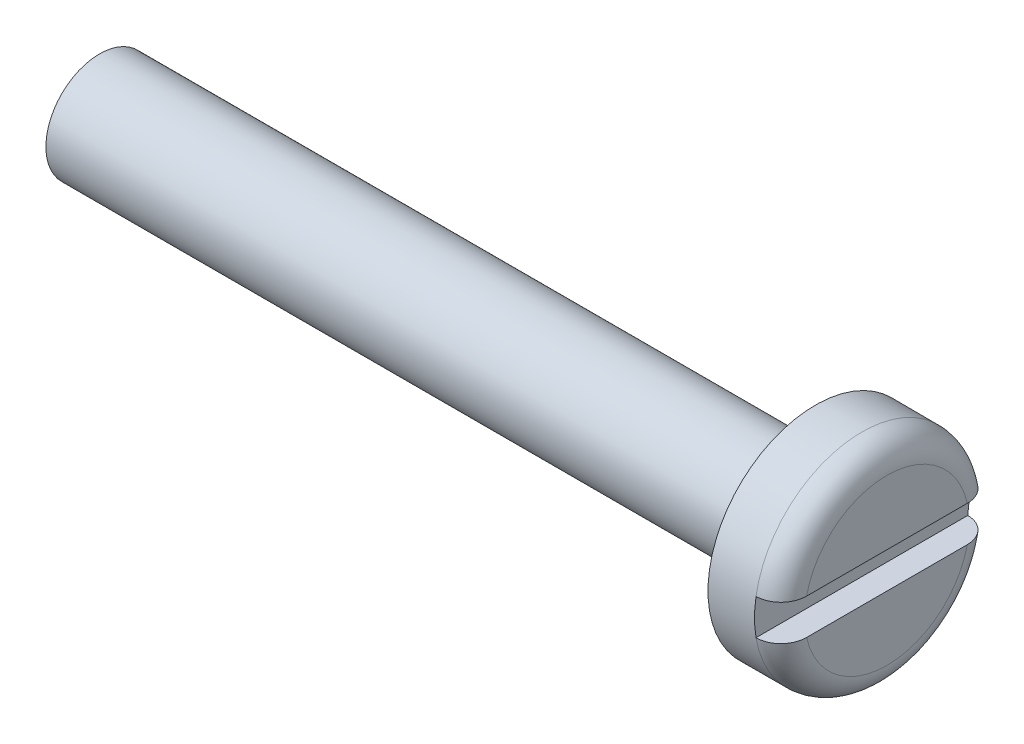
ISO-10303-21;
HEADER;
FILE_DESCRIPTION(('STEP AP214'),'2;1');
FILE_NAME('part.step','',(''),(''),'','','');
FILE_SCHEMA(('AUTOMOTIVE_DESIGN { 1 0 10303 214 1 1 1 1 }'));
ENDSEC;
DATA;
#1=APPLICATION_CONTEXT('core data for automotive mechanical design processes');
#2=APPLICATION_PROTOCOL_DEFINITION('international standard','automotive_design',2000,#1);
#3=PRODUCT_CONTEXT('',#1,'mechanical');
#4=PRODUCT('Part','Part','',(#3));
#5=PRODUCT_RELATED_PRODUCT_CATEGORY('part','',(#4));
#6=PRODUCT_DEFINITION_FORMATION('','',#4);
#7=PRODUCT_DEFINITION_CONTEXT('part definition',#1,'design');
#8=PRODUCT_DEFINITION('design','',#6,#7);
#9=PRODUCT_DEFINITION_SHAPE('','',#8);
#10=(LENGTH_UNIT() NAMED_UNIT(*) SI_UNIT(.MILLI.,.METRE.));
#11=(NAMED_UNIT(*) PLANE_ANGLE_UNIT() SI_UNIT($,.RADIAN.));
#12=(NAMED_UNIT(*) SI_UNIT($,.STERADIAN.) SOLID_ANGLE_UNIT());
#13=UNCERTAINTY_MEASURE_WITH_UNIT(LENGTH_MEASURE(1.E-05),#10,'distance_accuracy_value','');
#14=(GEOMETRIC_REPRESENTATION_CONTEXT(3) GLOBAL_UNCERTAINTY_ASSIGNED_CONTEXT((#13)) GLOBAL_UNIT_ASSIGNED_CONTEXT((#10,
#11,#12)) REPRESENTATION_CONTEXT('',''));
#15=CARTESIAN_POINT('',(0.,0.,0.));
#16=DIRECTION('',(0.,0.,1.));
#17=DIRECTION('',(1.,0.,0.));
#18=AXIS2_PLACEMENT_3D('',#15,#16,#17);
#19=CARTESIAN_POINT('',(2.,0.,0.));
#20=DIRECTION('',(1.,0.,0.));
#21=DIRECTION('',(0.,0.,-1.));
#22=AXIS2_PLACEMENT_3D('',#19,#20,#21);
#23=PLANE('',#22);
#24=DIRECTION('',(0.,0.,1.));
#25=VECTOR('',#24,1.);
#26=CARTESIAN_POINT('',(2.,0.5,0.));
#27=LINE('',#26,#25);
#28=CARTESIAN_POINT('',(2.,0.5,-2.24499443206437));
#29=VERTEX_POINT('',#28);
#30=CARTESIAN_POINT('',(2.,0.5,2.24499443206437));
#31=VERTEX_POINT('',#30);
#32=EDGE_CURVE('E166',#29,#31,#27,.T.);
#33=ORIENTED_EDGE('',*,*,#32,.F.);
#34=CARTESIAN_POINT('',(2.,0.,0.));
#35=DIRECTION('',(1.,0.,0.));
#36=DIRECTION('',(0.,0.,-1.));
#37=AXIS2_PLACEMENT_3D('',#34,#35,#36);
#38=CIRCLE('',#37,2.3);
#39=EDGE_CURVE('E93',#29,#31,#38,.T.);
#40=ORIENTED_EDGE('',*,*,#39,.T.);
#41=EDGE_LOOP('',(#33,#40));
#42=FACE_BOUND('',#41,.T.);
#43=ADVANCED_FACE('F36',(#42),#23,.T.);
#44=CARTESIAN_POINT('',(0.,0.,0.));
#45=DIRECTION('',(1.,0.,0.));
#46=DIRECTION('',(0.,0.,-1.));
#47=AXIS2_PLACEMENT_3D('',#44,#45,#46);
#48=CYLINDRICAL_SURFACE('',#47,1.5);
#49=CARTESIAN_POINT('',(-20.,0.,0.));
#50=DIRECTION('',(1.,0.,0.));
#51=DIRECTION('',(0.,0.,-1.));
#52=AXIS2_PLACEMENT_3D('',#49,#50,#51);
#53=CIRCLE('',#52,1.5);
#54=CARTESIAN_POINT('',(-20.,0.,-1.5));
#55=VERTEX_POINT('',#54);
#56=EDGE_CURVE('E160',#55,#55,#53,.T.);
#57=ORIENTED_EDGE('',*,*,#56,.T.);
#58=EDGE_LOOP('',(#57));
#59=FACE_BOUND('',#58,.T.);
#60=CARTESIAN_POINT('',(0.,0.,0.));
#61=DIRECTION('',(1.,0.,0.));
#62=DIRECTION('',(0.,0.,-1.));
#63=AXIS2_PLACEMENT_3D('',#60,#61,#62);
#64=CIRCLE('',#63,1.5);
#65=CARTESIAN_POINT('',(0.,0.,-1.5));
#66=VERTEX_POINT('',#65);
#67=EDGE_CURVE('E163',#66,#66,#64,.T.);
#68=ORIENTED_EDGE('',*,*,#67,.F.);
#69=EDGE_LOOP('',(#68));
#70=FACE_BOUND('',#69,.T.);
#71=ADVANCED_FACE('F149',(#59,#70),#48,.T.);
#72=CARTESIAN_POINT('',(-20.,0.,0.));
#73=DIRECTION('',(1.,0.,0.));
#74=DIRECTION('',(0.,0.,-1.));
#75=AXIS2_PLACEMENT_3D('',#72,#73,#74);
#76=PLANE('',#75);
#77=ORIENTED_EDGE('',*,*,#56,.F.);
#78=EDGE_LOOP('',(#77));
#79=FACE_BOUND('',#78,.T.);
#80=ADVANCED_FACE('F147',(#79),#76,.F.);
#81=CARTESIAN_POINT('',(2.,0.,0.));
#82=DIRECTION('',(-1.,0.,0.));
#83=DIRECTION('',(0.,0.,1.));
#84=AXIS2_PLACEMENT_3D('',#81,#82,#83);
#85=CYLINDRICAL_SURFACE('',#84,3.);
#86=CARTESIAN_POINT('',(1.3,0.,0.));
#87=DIRECTION('',(1.,0.,0.));
#88=DIRECTION('',(0.,0.,-1.));
#89=AXIS2_PLACEMENT_3D('',#86,#87,#88);
#90=CIRCLE('',#89,3.);
#91=CARTESIAN_POINT('',(1.3,-0.5,-2.95803989154981));
#92=VERTEX_POINT('',#91);
#93=CARTESIAN_POINT('',(1.3,0.5,-2.95803989154981));
#94=VERTEX_POINT('',#93);
#95=EDGE_CURVE('E90',#92,#94,#90,.T.);
#96=ORIENTED_EDGE('',*,*,#95,.F.);
#97=CARTESIAN_POINT('',(1.3,0.,0.));
#98=DIRECTION('',(1.,0.,0.));
#99=DIRECTION('',(0.,0.,-1.));
#100=AXIS2_PLACEMENT_3D('',#97,#98,#99);
#101=CIRCLE('',#100,3.);
#102=CARTESIAN_POINT('',(1.3,-0.5,2.95803989154981));
#103=VERTEX_POINT('',#102);
#104=EDGE_CURVE('E84',#92,#103,#101,.F.);
#105=ORIENTED_EDGE('',*,*,#104,.T.);
#106=CARTESIAN_POINT('',(1.3,0.5,2.95803989154981));
#107=VERTEX_POINT('',#106);
#108=EDGE_CURVE('E88',#107,#103,#90,.T.);
#109=ORIENTED_EDGE('',*,*,#108,.F.);
#110=CARTESIAN_POINT('',(1.3,0.,0.));
#111=DIRECTION('',(1.,0.,0.));
#112=DIRECTION('',(0.,0.,-1.));
#113=AXIS2_PLACEMENT_3D('',#110,#111,#112);
#114=CIRCLE('',#113,3.);
#115=EDGE_CURVE('E94',#107,#94,#114,.F.);
#116=ORIENTED_EDGE('',*,*,#115,.T.);
#117=EDGE_LOOP('',(#96,#105,#109,#116));
#118=FACE_BOUND('',#117,.T.);
#119=CARTESIAN_POINT('',(0.,0.,0.));
#120=DIRECTION('',(1.,0.,0.));
#121=DIRECTION('',(0.,0.,-1.));
#122=AXIS2_PLACEMENT_3D('',#119,#120,#121);
#123=CIRCLE('',#122,3.);
#124=CARTESIAN_POINT('',(0.,0.,-3.));
#125=VERTEX_POINT('',#124);
#126=EDGE_CURVE('E168',#125,#125,#123,.T.);
#127=ORIENTED_EDGE('',*,*,#126,.T.);
#128=EDGE_LOOP('',(#127));
#129=FACE_BOUND('',#128,.T.);
#130=ADVANCED_FACE('F86',(#118,#129),#85,.T.);
#131=DIRECTION('',(0.,0.,-1.));
#132=VECTOR('',#131,1.);
#133=CARTESIAN_POINT('',(2.,-0.5,0.));
#134=LINE('',#133,#132);
#135=CARTESIAN_POINT('',(2.,-0.5,2.24499443206437));
#136=VERTEX_POINT('',#135);
#137=CARTESIAN_POINT('',(2.,-0.5,-2.24499443206437));
#138=VERTEX_POINT('',#137);
#139=EDGE_CURVE('E164',#136,#138,#134,.T.);
#140=ORIENTED_EDGE('',*,*,#139,.F.);
#141=CARTESIAN_POINT('',(2.,0.,0.));
#142=DIRECTION('',(1.,0.,0.));
#143=DIRECTION('',(0.,0.,-1.));
#144=AXIS2_PLACEMENT_3D('',#141,#142,#143);
#145=CIRCLE('',#144,2.3);
#146=EDGE_CURVE('E103',#136,#138,#145,.T.);
#147=ORIENTED_EDGE('',*,*,#146,.T.);
#148=EDGE_LOOP('',(#140,#147));
#149=FACE_BOUND('',#148,.T.);
#150=ADVANCED_FACE('F136',(#149),#23,.T.);
#151=CARTESIAN_POINT('',(0.,0.,0.));
#152=DIRECTION('',(1.,0.,0.));
#153=DIRECTION('',(0.,0.,-1.));
#154=AXIS2_PLACEMENT_3D('',#151,#152,#153);
#155=PLANE('',#154);
#156=ORIENTED_EDGE('',*,*,#67,.T.);
#157=EDGE_LOOP('',(#156));
#158=FACE_BOUND('',#157,.T.);
#159=ORIENTED_EDGE('',*,*,#126,.F.);
#160=EDGE_LOOP('',(#159));
#161=FACE_BOUND('',#160,.T.);
#162=ADVANCED_FACE('F140',(#158,#161),#155,.F.);
#163=CARTESIAN_POINT('',(1.3,0.,0.));
#164=DIRECTION('',(1.,0.,0.));
#165=DIRECTION('',(0.,0.,-1.));
#166=AXIS2_PLACEMENT_3D('',#163,#164,#165);
#167=PLANE('',#166);
#168=ORIENTED_EDGE('',*,*,#108,.T.);
#169=DIRECTION('',(0.,0.,-1.));
#170=VECTOR('',#169,1.);
#171=CARTESIAN_POINT('',(1.3,-0.5,-3.5));
#172=LINE('',#171,#170);
#173=EDGE_CURVE('E101',#103,#92,#172,.T.);
#174=ORIENTED_EDGE('',*,*,#173,.T.);
#175=ORIENTED_EDGE('',*,*,#95,.T.);
#176=DIRECTION('',(0.,0.,1.));
#177=VECTOR('',#176,1.);
#178=CARTESIAN_POINT('',(1.3,0.5,-3.5));
#179=LINE('',#178,#177);
#180=EDGE_CURVE('E102',#94,#107,#179,.T.);
#181=ORIENTED_EDGE('',*,*,#180,.T.);
#182=EDGE_LOOP('',(#168,#174,#175,#181));
#183=FACE_BOUND('',#182,.T.);
#184=ADVANCED_FACE('F100',(#183),#167,.T.);
#185=CARTESIAN_POINT('',(1.3,0.5,-3.5));
#186=DIRECTION('',(0.,1.,0.));
#187=DIRECTION('',(0.,0.,1.));
#188=AXIS2_PLACEMENT_3D('',#185,#186,#187);
#189=PLANE('',#188);
#190=ORIENTED_EDGE('',*,*,#32,.T.);
#191=CARTESIAN_POINT('',(2.,0.5,2.24499443206437));
#192=CARTESIAN_POINT('',(2.00003349959771,0.5,2.28573983911845));
#193=CARTESIAN_POINT('',(1.99661220850471,0.5,2.32648731289159));
#194=CARTESIAN_POINT('',(1.98304137920813,0.5,2.40684703337132));
#195=CARTESIAN_POINT('',(1.9728916261087,0.5,2.44645924377733));
#196=CARTESIAN_POINT('',(1.94603249644508,0.5,2.52344281997325));
#197=CARTESIAN_POINT('',(1.92931690732165,0.5,2.5608120247246));
#198=CARTESIAN_POINT('',(1.88976531724205,0.5,2.63213936403724));
#199=CARTESIAN_POINT('',(1.86693213097854,0.5,2.66609905745348));
#200=CARTESIAN_POINT('',(1.81613608019696,0.5,2.72911851568481));
#201=CARTESIAN_POINT('',(1.78825319169517,0.5,2.75824272590663));
#202=CARTESIAN_POINT('',(1.72790796746009,0.5,2.81130240024623));
#203=CARTESIAN_POINT('',(1.69544477640723,0.5,2.83523689312062));
#204=CARTESIAN_POINT('',(1.62747811413737,0.5,2.87679832134027));
#205=CARTESIAN_POINT('',(1.59203661390523,0.5,2.89452676383628));
#206=CARTESIAN_POINT('',(1.51866613277533,0.5,2.92368871457025));
#207=CARTESIAN_POINT('',(1.48073919771057,0.5,2.93512732908223));
#208=CARTESIAN_POINT('',(1.41877078274276,0.5,2.94816583324927));
#209=CARTESIAN_POINT('',(1.39515134161437,0.5,2.95186676666806));
#210=CARTESIAN_POINT('',(1.34769155268949,0.5,2.95680300716274));
#211=CARTESIAN_POINT('',(1.3238515828252,0.5,2.95804194896381));
#212=CARTESIAN_POINT('',(1.3,0.5,2.95803989154981));
#213=B_SPLINE_CURVE_WITH_KNOTS('',3,(#191,#192,#193,#194,#195,#196,#197,#198,#199,#200,#201,
#202,#203,#204,#205,#206,#207,#208,#209,#210,#211,#212),.UNSPECIFIED.,.F.,.F.,(4,2,2,2,2,2,2,2,
2,2,4),(0.,0.122096648982427,0.244197197716104,0.36641355672264,0.488573780535588,
0.608945922114475,0.729340571649887,0.847662282937279,0.965887794700322,1.03749345541183,
1.10899332338545),.UNSPECIFIED.);
#214=EDGE_CURVE('E11',#31,#107,#213,.T.);
#215=ORIENTED_EDGE('',*,*,#214,.T.);
#216=ORIENTED_EDGE('',*,*,#180,.F.);
#217=CARTESIAN_POINT('',(1.3,0.5,-2.95803989154981));
#218=CARTESIAN_POINT('',(1.33895276824604,0.5,-2.9580750998827));
#219=CARTESIAN_POINT('',(1.37789301137769,0.5,-2.95474458011748));
#220=CARTESIAN_POINT('',(1.45462410688185,0.5,-2.9416148221459));
#221=CARTESIAN_POINT('',(1.49241620126766,0.5,-2.93182285468263));
#222=CARTESIAN_POINT('',(1.56583267937175,0.5,-2.90602706612674));
#223=CARTESIAN_POINT('',(1.60145625142087,0.5,-2.89002093543562));
#224=CARTESIAN_POINT('',(1.66952582830892,0.5,-2.852288717398));
#225=CARTESIAN_POINT('',(1.7019720962165,0.5,-2.83056310415313));
#226=CARTESIAN_POINT('',(1.76296306014766,0.5,-2.78190303328287));
#227=CARTESIAN_POINT('',(1.79148682879243,0.5,-2.7549423572489));
#228=CARTESIAN_POINT('',(1.84367878065181,0.5,-2.69666719089695));
#229=CARTESIAN_POINT('',(1.86734610079564,0.5,-2.66535192835342));
#230=CARTESIAN_POINT('',(1.90950017088595,0.5,-2.59881748051941));
#231=CARTESIAN_POINT('',(1.92791253061264,0.5,-2.56355122637335));
#232=CARTESIAN_POINT('',(1.95867008819671,0.5,-2.49046844887916));
#233=CARTESIAN_POINT('',(1.97101672218287,0.5,-2.45265253160607));
#234=CARTESIAN_POINT('',(1.98678665310998,0.5,-2.38640681356013));
#235=CARTESIAN_POINT('',(1.99174343997106,0.5,-2.35833111107909));
#236=CARTESIAN_POINT('',(1.99835000205119,0.5,-2.30183758094823));
#237=CARTESIAN_POINT('',(2.00000494182539,0.5,-2.27342035764769));
#238=CARTESIAN_POINT('',(2.,0.5,-2.24499443206437));
#239=B_SPLINE_CURVE_WITH_KNOTS('',3,(#217,#218,#219,#220,#221,#222,#223,#224,#225,#226,#227,
#228,#229,#230,#231,#232,#233,#234,#235,#236,#237,#238),.UNSPECIFIED.,.F.,.F.,(4,2,2,2,2,2,2,2,
2,2,4),(0.,0.116697739544289,0.233264388387375,0.349874402729144,0.466474754028774,
0.583674873884878,0.700895804125441,0.819702019538682,0.938480092672275,1.02382541405407,
1.10903713831698),.UNSPECIFIED.);
#240=EDGE_CURVE('E50',#94,#29,#239,.T.);
#241=ORIENTED_EDGE('',*,*,#240,.T.);
#242=EDGE_LOOP('',(#190,#215,#216,#241));
#243=FACE_BOUND('',#242,.T.);
#244=ADVANCED_FACE('F133',(#243),#189,.F.);
#245=CARTESIAN_POINT('',(1.3,-0.5,-3.5));
#246=DIRECTION('',(0.,-1.,0.));
#247=DIRECTION('',(0.,0.,-1.));
#248=AXIS2_PLACEMENT_3D('',#245,#246,#247);
#249=PLANE('',#248);
#250=ORIENTED_EDGE('',*,*,#139,.T.);
#251=CARTESIAN_POINT('',(2.,-0.5,-2.24499443206437));
#252=CARTESIAN_POINT('',(2.00003349959771,-0.5,-2.28573983911845));
#253=CARTESIAN_POINT('',(1.99661220850471,-0.5,-2.32648731289159));
#254=CARTESIAN_POINT('',(1.98304137920813,-0.5,-2.40684703337132));
#255=CARTESIAN_POINT('',(1.9728916261087,-0.5,-2.44645924377733));
#256=CARTESIAN_POINT('',(1.94603249644508,-0.5,-2.52344281997325));
#257=CARTESIAN_POINT('',(1.92931690732165,-0.5,-2.5608120247246));
#258=CARTESIAN_POINT('',(1.88976531724205,-0.5,-2.63213936403724));
#259=CARTESIAN_POINT('',(1.86693213097854,-0.5,-2.66609905745348));
#260=CARTESIAN_POINT('',(1.81613608019696,-0.5,-2.72911851568481));
#261=CARTESIAN_POINT('',(1.78825319169517,-0.5,-2.75824272590663));
#262=CARTESIAN_POINT('',(1.72790796746009,-0.5,-2.81130240024623));
#263=CARTESIAN_POINT('',(1.69544477640723,-0.5,-2.83523689312062));
#264=CARTESIAN_POINT('',(1.62747811413737,-0.5,-2.87679832134027));
#265=CARTESIAN_POINT('',(1.59203661390523,-0.5,-2.89452676383628));
#266=CARTESIAN_POINT('',(1.51866613277533,-0.5,-2.92368871457025));
#267=CARTESIAN_POINT('',(1.48073919771057,-0.5,-2.93512732908223));
#268=CARTESIAN_POINT('',(1.41877078274276,-0.5,-2.94816583324927));
#269=CARTESIAN_POINT('',(1.39515134161437,-0.5,-2.95186676666806));
#270=CARTESIAN_POINT('',(1.34769155268949,-0.5,-2.95680300716274));
#271=CARTESIAN_POINT('',(1.3238515828252,-0.5,-2.95804194896381));
#272=CARTESIAN_POINT('',(1.3,-0.5,-2.95803989154981));
#273=B_SPLINE_CURVE_WITH_KNOTS('',3,(#251,#252,#253,#254,#255,#256,#257,#258,#259,#260,#261,
#262,#263,#264,#265,#266,#267,#268,#269,#270,#271,#272),.UNSPECIFIED.,.F.,.F.,(4,2,2,2,2,2,2,2,
2,2,4),(0.,0.122096648982427,0.244197197716104,0.36641355672264,0.488573780535588,
0.608945922114475,0.729340571649887,0.847662282937279,0.965887794700322,1.03749345541183,
1.10899332338545),.UNSPECIFIED.);
#274=EDGE_CURVE('E110',#138,#92,#273,.T.);
#275=ORIENTED_EDGE('',*,*,#274,.T.);
#276=ORIENTED_EDGE('',*,*,#173,.F.);
#277=CARTESIAN_POINT('',(1.3,-0.5,2.95803989154981));
#278=CARTESIAN_POINT('',(1.33895276824604,-0.5,2.9580750998827));
#279=CARTESIAN_POINT('',(1.37789301137769,-0.5,2.95474458011748));
#280=CARTESIAN_POINT('',(1.45462410688185,-0.5,2.9416148221459));
#281=CARTESIAN_POINT('',(1.49241620126766,-0.5,2.93182285468263));
#282=CARTESIAN_POINT('',(1.56583267937175,-0.5,2.90602706612674));
#283=CARTESIAN_POINT('',(1.60145625142087,-0.5,2.89002093543562));
#284=CARTESIAN_POINT('',(1.66952582830892,-0.5,2.852288717398));
#285=CARTESIAN_POINT('',(1.7019720962165,-0.5,2.83056310415313));
#286=CARTESIAN_POINT('',(1.76296306014766,-0.5,2.78190303328287));
#287=CARTESIAN_POINT('',(1.79148682879243,-0.5,2.7549423572489));
#288=CARTESIAN_POINT('',(1.84367878065181,-0.5,2.69666719089695));
#289=CARTESIAN_POINT('',(1.86734610079564,-0.5,2.66535192835342));
#290=CARTESIAN_POINT('',(1.90950017088595,-0.5,2.59881748051941));
#291=CARTESIAN_POINT('',(1.92791253061264,-0.5,2.56355122637335));
#292=CARTESIAN_POINT('',(1.95867008819671,-0.5,2.49046844887916));
#293=CARTESIAN_POINT('',(1.97101672218287,-0.5,2.45265253160607));
#294=CARTESIAN_POINT('',(1.98678665310998,-0.5,2.38640681356013));
#295=CARTESIAN_POINT('',(1.99174343997106,-0.5,2.35833111107909));
#296=CARTESIAN_POINT('',(1.99835000205119,-0.5,2.30183758094823));
#297=CARTESIAN_POINT('',(2.00000494182539,-0.5,2.27342035764769));
#298=CARTESIAN_POINT('',(2.,-0.5,2.24499443206437));
#299=B_SPLINE_CURVE_WITH_KNOTS('',3,(#277,#278,#279,#280,#281,#282,#283,#284,#285,#286,#287,
#288,#289,#290,#291,#292,#293,#294,#295,#296,#297,#298),.UNSPECIFIED.,.F.,.F.,(4,2,2,2,2,2,2,2,
2,2,4),(0.,0.116697739544289,0.233264388387375,0.349874402729144,0.466474754028774,
0.583674873884878,0.700895804125441,0.819702019538682,0.938480092672275,1.02382541405407,
1.10903713831698),.UNSPECIFIED.);
#300=EDGE_CURVE('E108',#103,#136,#299,.T.);
#301=ORIENTED_EDGE('',*,*,#300,.T.);
#302=EDGE_LOOP('',(#250,#275,#276,#301));
#303=FACE_BOUND('',#302,.T.);
#304=ADVANCED_FACE('F107',(#303),#249,.F.);
#305=CARTESIAN_POINT('',(1.3,0.,0.));
#306=DIRECTION('',(1.,0.,0.));
#307=DIRECTION('',(0.,0.,-1.));
#308=AXIS2_PLACEMENT_3D('',#305,#306,#307);
#309=TOROIDAL_SURFACE('',#308,2.3,0.7);
#310=ORIENTED_EDGE('',*,*,#300,.F.);
#311=ORIENTED_EDGE('',*,*,#104,.F.);
#312=ORIENTED_EDGE('',*,*,#274,.F.);
#313=ORIENTED_EDGE('',*,*,#146,.F.);
#314=EDGE_LOOP('',(#310,#311,#312,#313));
#315=FACE_BOUND('',#314,.T.);
#316=ADVANCED_FACE('F113',(#315),#309,.T.);
#317=CARTESIAN_POINT('',(1.3,0.,0.));
#318=DIRECTION('',(1.,0.,0.));
#319=DIRECTION('',(0.,0.,-1.));
#320=AXIS2_PLACEMENT_3D('',#317,#318,#319);
#321=TOROIDAL_SURFACE('',#320,2.3,0.7);
#322=ORIENTED_EDGE('',*,*,#240,.F.);
#323=ORIENTED_EDGE('',*,*,#115,.F.);
#324=ORIENTED_EDGE('',*,*,#214,.F.);
#325=ORIENTED_EDGE('',*,*,#39,.F.);
#326=EDGE_LOOP('',(#322,#323,#324,#325));
#327=FACE_BOUND('',#326,.T.);
#328=ADVANCED_FACE('F38',(#327),#321,.T.);
#329=CLOSED_SHELL('',(#43,#71,#80,#130,#150,#162,#184,#244,#304,#316,#328));
#330=MANIFOLD_SOLID_BREP('B2',#329);
#331=ADVANCED_BREP_SHAPE_REPRESENTATION('',(#18,#330),#14);
#332=SHAPE_DEFINITION_REPRESENTATION(#9,#331);
ENDSEC;
END-ISO-10303-21;
